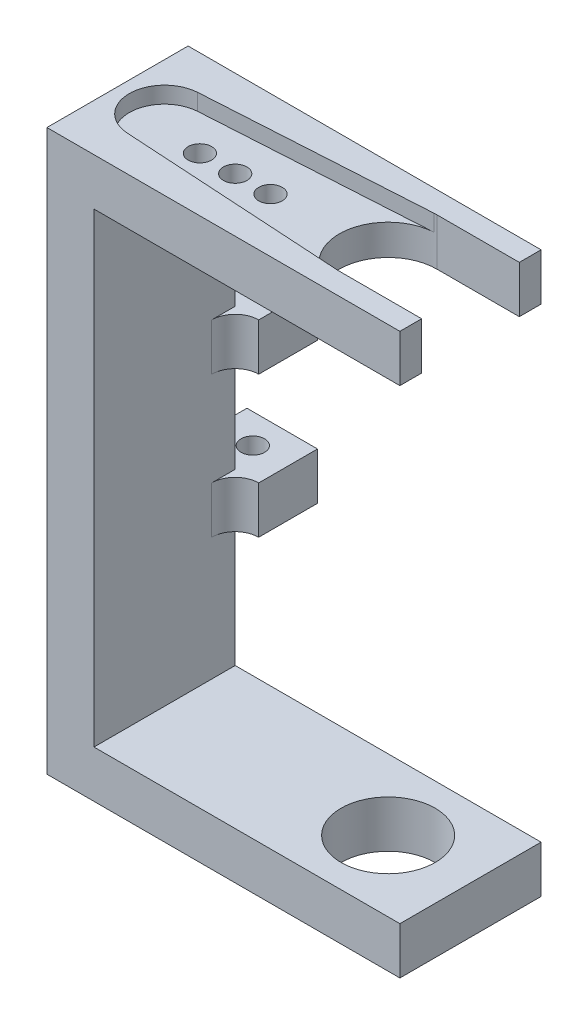
ISO-10303-21;
HEADER;
FILE_DESCRIPTION(('STEP AP214'),'2;1');
FILE_NAME('part.step','',(''),(''),'','','');
FILE_SCHEMA(('AUTOMOTIVE_DESIGN { 1 0 10303 214 1 1 1 1 }'));
ENDSEC;
DATA;
#1=APPLICATION_CONTEXT('core data for automotive mechanical design processes');
#2=APPLICATION_PROTOCOL_DEFINITION('international standard','automotive_design',2000,#1);
#3=PRODUCT_CONTEXT('',#1,'mechanical');
#4=PRODUCT('Part','Part','',(#3));
#5=PRODUCT_RELATED_PRODUCT_CATEGORY('part','',(#4));
#6=PRODUCT_DEFINITION_FORMATION('','',#4);
#7=PRODUCT_DEFINITION_CONTEXT('part definition',#1,'design');
#8=PRODUCT_DEFINITION('design','',#6,#7);
#9=PRODUCT_DEFINITION_SHAPE('','',#8);
#10=(LENGTH_UNIT() NAMED_UNIT(*) SI_UNIT(.MILLI.,.METRE.));
#11=(NAMED_UNIT(*) PLANE_ANGLE_UNIT() SI_UNIT($,.RADIAN.));
#12=(NAMED_UNIT(*) SI_UNIT($,.STERADIAN.) SOLID_ANGLE_UNIT());
#13=UNCERTAINTY_MEASURE_WITH_UNIT(LENGTH_MEASURE(1.E-05),#10,'distance_accuracy_value','');
#14=(GEOMETRIC_REPRESENTATION_CONTEXT(3) GLOBAL_UNCERTAINTY_ASSIGNED_CONTEXT((#13)) GLOBAL_UNIT_ASSIGNED_CONTEXT((#10,
#11,#12)) REPRESENTATION_CONTEXT('',''));
#15=CARTESIAN_POINT('',(0.,0.,0.));
#16=DIRECTION('',(0.,0.,1.));
#17=DIRECTION('',(1.,0.,0.));
#18=AXIS2_PLACEMENT_3D('',#15,#16,#17);
#19=CARTESIAN_POINT('',(-20.,0.,0.));
#20=DIRECTION('',(0.,0.,1.));
#21=DIRECTION('',(-1.,0.,0.));
#22=AXIS2_PLACEMENT_3D('',#19,#20,#21);
#23=PLANE('',#22);
#24=DIRECTION('',(1.,0.,0.));
#25=VECTOR('',#24,1.);
#26=CARTESIAN_POINT('',(-20.,10.44,0.));
#27=LINE('',#26,#25);
#28=CARTESIAN_POINT('',(-50.,10.44,0.));
#29=VERTEX_POINT('',#28);
#30=CARTESIAN_POINT('',(-46.,10.44,0.));
#31=VERTEX_POINT('',#30);
#32=EDGE_CURVE('E295',#29,#31,#27,.T.);
#33=ORIENTED_EDGE('',*,*,#32,.T.);
#34=DIRECTION('',(0.,-1.,0.));
#35=VECTOR('',#34,1.);
#36=CARTESIAN_POINT('',(-46.,0.,0.));
#37=LINE('',#36,#35);
#38=CARTESIAN_POINT('',(-46.,0.,0.));
#39=VERTEX_POINT('',#38);
#40=EDGE_CURVE('E430',#31,#39,#37,.T.);
#41=ORIENTED_EDGE('',*,*,#40,.T.);
#42=DIRECTION('',(1.,0.,0.));
#43=VECTOR('',#42,1.);
#44=CARTESIAN_POINT('',(-20.,0.,0.));
#45=LINE('',#44,#43);
#46=CARTESIAN_POINT('',(-20.,0.,0.));
#47=VERTEX_POINT('',#46);
#48=EDGE_CURVE('E392',#39,#47,#45,.T.);
#49=ORIENTED_EDGE('',*,*,#48,.T.);
#50=DIRECTION('',(0.,-1.,0.));
#51=VECTOR('',#50,1.);
#52=CARTESIAN_POINT('',(-20.,0.,0.));
#53=LINE('',#52,#51);
#54=CARTESIAN_POINT('',(-20.,-4.,0.));
#55=VERTEX_POINT('',#54);
#56=EDGE_CURVE('E385',#47,#55,#53,.T.);
#57=ORIENTED_EDGE('',*,*,#56,.T.);
#58=DIRECTION('',(-1.,0.,0.));
#59=VECTOR('',#58,1.);
#60=CARTESIAN_POINT('',(-20.,-4.,0.));
#61=LINE('',#60,#59);
#62=CARTESIAN_POINT('',(-50.,-4.,0.));
#63=VERTEX_POINT('',#62);
#64=EDGE_CURVE('E414',#55,#63,#61,.T.);
#65=ORIENTED_EDGE('',*,*,#64,.T.);
#66=DIRECTION('',(0.,1.,0.));
#67=VECTOR('',#66,1.);
#68=CARTESIAN_POINT('',(-50.,-4.,0.));
#69=LINE('',#68,#67);
#70=EDGE_CURVE('E418',#63,#29,#69,.T.);
#71=ORIENTED_EDGE('',*,*,#70,.T.);
#72=EDGE_LOOP('',(#33,#41,#49,#57,#65,#71));
#73=FACE_BOUND('',#72,.T.);
#74=ADVANCED_FACE('F43',(#73),#23,.F.);
#75=DIRECTION('',(-1.,0.,0.));
#76=VECTOR('',#75,1.);
#77=CARTESIAN_POINT('',(-44.,26.44,0.));
#78=LINE('',#77,#76);
#79=CARTESIAN_POINT('',(-46.,26.44,0.));
#80=VERTEX_POINT('',#79);
#81=CARTESIAN_POINT('',(-50.,26.44,0.));
#82=VERTEX_POINT('',#81);
#83=EDGE_CURVE('E278',#80,#82,#78,.T.);
#84=ORIENTED_EDGE('',*,*,#83,.T.);
#85=CARTESIAN_POINT('',(-50.,43.6,0.));
#86=VERTEX_POINT('',#85);
#87=EDGE_CURVE('E417',#82,#86,#69,.T.);
#88=ORIENTED_EDGE('',*,*,#87,.T.);
#89=DIRECTION('',(1.,0.,0.));
#90=VECTOR('',#89,1.);
#91=CARTESIAN_POINT('',(-50.,43.6,0.));
#92=LINE('',#91,#90);
#93=CARTESIAN_POINT('',(-20.,43.6,0.));
#94=VERTEX_POINT('',#93);
#95=EDGE_CURVE('E421',#86,#94,#92,.T.);
#96=ORIENTED_EDGE('',*,*,#95,.T.);
#97=DIRECTION('',(0.,-1.,0.));
#98=VECTOR('',#97,1.);
#99=CARTESIAN_POINT('',(-20.,43.6,0.));
#100=LINE('',#99,#98);
#101=CARTESIAN_POINT('',(-20.,39.6,0.));
#102=VERTEX_POINT('',#101);
#103=EDGE_CURVE('E424',#94,#102,#100,.T.);
#104=ORIENTED_EDGE('',*,*,#103,.T.);
#105=DIRECTION('',(-1.,0.,0.));
#106=VECTOR('',#105,1.);
#107=CARTESIAN_POINT('',(-46.,39.6,0.));
#108=LINE('',#107,#106);
#109=CARTESIAN_POINT('',(-46.,39.6,0.));
#110=VERTEX_POINT('',#109);
#111=EDGE_CURVE('E427',#102,#110,#108,.T.);
#112=ORIENTED_EDGE('',*,*,#111,.T.);
#113=EDGE_CURVE('E431',#110,#80,#37,.T.);
#114=ORIENTED_EDGE('',*,*,#113,.T.);
#115=EDGE_LOOP('',(#84,#88,#96,#104,#112,#114));
#116=FACE_BOUND('',#115,.T.);
#117=ADVANCED_FACE('F511',(#116),#23,.F.);
#118=CARTESIAN_POINT('',(-50.,43.6,12.));
#119=DIRECTION('',(0.,-1.,0.));
#120=DIRECTION('',(0.,0.,-1.));
#121=AXIS2_PLACEMENT_3D('',#118,#119,#120);
#122=PLANE('',#121);
#123=CARTESIAN_POINT('',(-46.,43.6,6.));
#124=DIRECTION('',(0.,-1.,0.));
#125=DIRECTION('',(0.,0.,1.));
#126=AXIS2_PLACEMENT_3D('',#123,#124,#125);
#127=CIRCLE('',#126,3.);
#128=CARTESIAN_POINT('',(-46.1815789473684,43.6,8.99449980562239));
#129=VERTEX_POINT('',#128);
#130=CARTESIAN_POINT('',(-46.1815789473684,43.6,3.0055001943776));
#131=VERTEX_POINT('',#130);
#132=EDGE_CURVE('E343',#129,#131,#127,.T.);
#133=ORIENTED_EDGE('',*,*,#132,.T.);
#134=DIRECTION('',(-0.998166601874133,0.,0.0605263157894736));
#135=VECTOR('',#134,1.);
#136=CARTESIAN_POINT('',(-19.9143361731144,43.6,1.41272056411529));
#137=LINE('',#136,#135);
#138=CARTESIAN_POINT('',(-27.2511842105263,43.6,1.85760860222235));
#139=VERTEX_POINT('',#138);
#140=EDGE_CURVE('E332',#139,#131,#137,.T.);
#141=ORIENTED_EDGE('',*,*,#140,.F.);
#142=CARTESIAN_POINT('',(-27.,43.6,6.));
#143=DIRECTION('',(0.,-1.,0.));
#144=DIRECTION('',(0.,0.,1.));
#145=AXIS2_PLACEMENT_3D('',#142,#143,#144);
#146=CIRCLE('',#145,4.15);
#147=CARTESIAN_POINT('',(-27.,43.6,1.85));
#148=VERTEX_POINT('',#147);
#149=EDGE_CURVE('E350',#139,#148,#146,.T.);
#150=ORIENTED_EDGE('',*,*,#149,.T.);
#151=DIRECTION('',(1.,0.,0.));
#152=VECTOR('',#151,1.);
#153=CARTESIAN_POINT('',(-20.,43.6,1.85));
#154=LINE('',#153,#152);
#155=CARTESIAN_POINT('',(-20.,43.6,1.85));
#156=VERTEX_POINT('',#155);
#157=EDGE_CURVE('E369',#148,#156,#154,.T.);
#158=ORIENTED_EDGE('',*,*,#157,.T.);
#159=DIRECTION('',(0.,0.,-1.));
#160=VECTOR('',#159,1.);
#161=CARTESIAN_POINT('',(-20.,43.6,12.));
#162=LINE('',#161,#160);
#163=EDGE_CURVE('E445',#156,#94,#162,.T.);
#164=ORIENTED_EDGE('',*,*,#163,.T.);
#165=ORIENTED_EDGE('',*,*,#95,.F.);
#166=DIRECTION('',(0.,0.,-1.));
#167=VECTOR('',#166,1.);
#168=CARTESIAN_POINT('',(-50.,43.6,12.));
#169=LINE('',#168,#167);
#170=CARTESIAN_POINT('',(-50.,43.6,12.));
#171=VERTEX_POINT('',#170);
#172=EDGE_CURVE('E449',#171,#86,#169,.T.);
#173=ORIENTED_EDGE('',*,*,#172,.F.);
#174=DIRECTION('',(1.,0.,0.));
#175=VECTOR('',#174,1.);
#176=CARTESIAN_POINT('',(-50.,43.6,12.));
#177=LINE('',#176,#175);
#178=CARTESIAN_POINT('',(-20.,43.6,12.));
#179=VERTEX_POINT('',#178);
#180=EDGE_CURVE('E397',#171,#179,#177,.T.);
#181=ORIENTED_EDGE('',*,*,#180,.T.);
#182=CARTESIAN_POINT('',(-20.,43.6,10.15));
#183=VERTEX_POINT('',#182);
#184=EDGE_CURVE('E446',#179,#183,#162,.T.);
#185=ORIENTED_EDGE('',*,*,#184,.T.);
#186=DIRECTION('',(1.,0.,0.));
#187=VECTOR('',#186,1.);
#188=CARTESIAN_POINT('',(-20.,43.6,10.15));
#189=LINE('',#188,#187);
#190=CARTESIAN_POINT('',(-27.,43.6,10.15));
#191=VERTEX_POINT('',#190);
#192=EDGE_CURVE('E360',#191,#183,#189,.T.);
#193=ORIENTED_EDGE('',*,*,#192,.F.);
#194=CARTESIAN_POINT('',(-27.2511842105263,43.6,10.1423913977776));
#195=VERTEX_POINT('',#194);
#196=EDGE_CURVE('E366',#191,#195,#146,.T.);
#197=ORIENTED_EDGE('',*,*,#196,.T.);
#198=DIRECTION('',(-0.998166601874133,0.,-0.0605263157894737));
#199=VECTOR('',#198,1.);
#200=CARTESIAN_POINT('',(-20.6393203365809,43.6,10.5433182170481));
#201=LINE('',#200,#199);
#202=EDGE_CURVE('E327',#195,#129,#201,.T.);
#203=ORIENTED_EDGE('',*,*,#202,.T.);
#204=EDGE_LOOP('',(#133,#141,#150,#158,#164,#165,#173,#181,#185,#193,#197,#203));
#205=FACE_BOUND('',#204,.T.);
#206=ADVANCED_FACE('F517',(#205),#122,.F.);
#207=CARTESIAN_POINT('',(-20.,43.6,12.));
#208=DIRECTION('',(-1.,0.,0.));
#209=DIRECTION('',(0.,1.,0.));
#210=AXIS2_PLACEMENT_3D('',#207,#208,#209);
#211=PLANE('',#210);
#212=DIRECTION('',(0.,1.,0.));
#213=VECTOR('',#212,1.);
#214=CARTESIAN_POINT('',(-20.,39.6,10.15));
#215=LINE('',#214,#213);
#216=CARTESIAN_POINT('',(-20.,39.6,10.15));
#217=VERTEX_POINT('',#216);
#218=EDGE_CURVE('E377',#217,#183,#215,.T.);
#219=ORIENTED_EDGE('',*,*,#218,.T.);
#220=ORIENTED_EDGE('',*,*,#184,.F.);
#221=DIRECTION('',(0.,-1.,0.));
#222=VECTOR('',#221,1.);
#223=CARTESIAN_POINT('',(-20.,43.6,12.));
#224=LINE('',#223,#222);
#225=CARTESIAN_POINT('',(-20.,39.6,12.));
#226=VERTEX_POINT('',#225);
#227=EDGE_CURVE('E400',#179,#226,#224,.T.);
#228=ORIENTED_EDGE('',*,*,#227,.T.);
#229=DIRECTION('',(0.,0.,-1.));
#230=VECTOR('',#229,1.);
#231=CARTESIAN_POINT('',(-20.,39.6,12.));
#232=LINE('',#231,#230);
#233=EDGE_CURVE('E442',#226,#217,#232,.T.);
#234=ORIENTED_EDGE('',*,*,#233,.T.);
#235=EDGE_LOOP('',(#219,#220,#228,#234));
#236=FACE_BOUND('',#235,.T.);
#237=ADVANCED_FACE('F588',(#236),#211,.F.);
#238=CARTESIAN_POINT('',(-46.,39.6,12.));
#239=DIRECTION('',(0.,1.,0.));
#240=DIRECTION('',(0.,0.,1.));
#241=AXIS2_PLACEMENT_3D('',#238,#239,#240);
#242=PLANE('',#241);
#243=CARTESIAN_POINT('',(-43.,39.6,6.));
#244=DIRECTION('',(0.,-1.,0.));
#245=DIRECTION('',(0.,0.,1.));
#246=AXIS2_PLACEMENT_3D('',#243,#244,#245);
#247=CIRCLE('',#246,1.);
#248=CARTESIAN_POINT('',(-43.,39.6,7.));
#249=VERTEX_POINT('',#248);
#250=EDGE_CURVE('E310',#249,#249,#247,.T.);
#251=ORIENTED_EDGE('',*,*,#250,.F.);
#252=EDGE_LOOP('',(#251));
#253=FACE_BOUND('',#252,.T.);
#254=CARTESIAN_POINT('',(-40.,39.6,6.));
#255=DIRECTION('',(0.,-1.,0.));
#256=DIRECTION('',(0.,0.,1.));
#257=AXIS2_PLACEMENT_3D('',#254,#255,#256);
#258=CIRCLE('',#257,1.);
#259=CARTESIAN_POINT('',(-40.,39.6,7.));
#260=VERTEX_POINT('',#259);
#261=EDGE_CURVE('E314',#260,#260,#258,.T.);
#262=ORIENTED_EDGE('',*,*,#261,.F.);
#263=EDGE_LOOP('',(#262));
#264=FACE_BOUND('',#263,.T.);
#265=CARTESIAN_POINT('',(-37.,39.6,6.));
#266=DIRECTION('',(0.,-1.,0.));
#267=DIRECTION('',(0.,0.,1.));
#268=AXIS2_PLACEMENT_3D('',#265,#266,#267);
#269=CIRCLE('',#268,1.);
#270=CARTESIAN_POINT('',(-37.,39.6,7.));
#271=VERTEX_POINT('',#270);
#272=EDGE_CURVE('E309',#271,#271,#269,.T.);
#273=ORIENTED_EDGE('',*,*,#272,.F.);
#274=EDGE_LOOP('',(#273));
#275=FACE_BOUND('',#274,.T.);
#276=DIRECTION('',(1.,0.,0.));
#277=VECTOR('',#276,1.);
#278=CARTESIAN_POINT('',(-20.,39.6,10.15));
#279=LINE('',#278,#277);
#280=CARTESIAN_POINT('',(-27.,39.6,10.15));
#281=VERTEX_POINT('',#280);
#282=EDGE_CURVE('E363',#281,#217,#279,.T.);
#283=ORIENTED_EDGE('',*,*,#282,.T.);
#284=ORIENTED_EDGE('',*,*,#233,.F.);
#285=DIRECTION('',(-1.,0.,0.));
#286=VECTOR('',#285,1.);
#287=CARTESIAN_POINT('',(-46.,39.6,12.));
#288=LINE('',#287,#286);
#289=CARTESIAN_POINT('',(-46.,39.6,12.));
#290=VERTEX_POINT('',#289);
#291=EDGE_CURVE('E403',#226,#290,#288,.T.);
#292=ORIENTED_EDGE('',*,*,#291,.T.);
#293=DIRECTION('',(0.,0.,-1.));
#294=VECTOR('',#293,1.);
#295=CARTESIAN_POINT('',(-46.,39.6,12.));
#296=LINE('',#295,#294);
#297=EDGE_CURVE('E439',#290,#110,#296,.T.);
#298=ORIENTED_EDGE('',*,*,#297,.T.);
#299=ORIENTED_EDGE('',*,*,#111,.F.);
#300=CARTESIAN_POINT('',(-20.,39.6,1.85));
#301=VERTEX_POINT('',#300);
#302=EDGE_CURVE('E441',#301,#102,#232,.T.);
#303=ORIENTED_EDGE('',*,*,#302,.F.);
#304=DIRECTION('',(1.,0.,0.));
#305=VECTOR('',#304,1.);
#306=CARTESIAN_POINT('',(-20.,39.6,1.85));
#307=LINE('',#306,#305);
#308=CARTESIAN_POINT('',(-27.,39.6,1.85));
#309=VERTEX_POINT('',#308);
#310=EDGE_CURVE('E359',#309,#301,#307,.T.);
#311=ORIENTED_EDGE('',*,*,#310,.F.);
#312=CARTESIAN_POINT('',(-27.,39.6,6.));
#313=DIRECTION('',(0.,-1.,0.));
#314=DIRECTION('',(0.,0.,1.));
#315=AXIS2_PLACEMENT_3D('',#312,#313,#314);
#316=CIRCLE('',#315,4.15);
#317=EDGE_CURVE('E356',#281,#309,#316,.T.);
#318=ORIENTED_EDGE('',*,*,#317,.F.);
#319=EDGE_LOOP('',(#283,#284,#292,#298,#299,#303,#311,#318));
#320=FACE_BOUND('',#319,.T.);
#321=ADVANCED_FACE('F584',(#253,#264,#275,#320),#242,.F.);
#322=CARTESIAN_POINT('',(-20.,0.,12.));
#323=DIRECTION('',(-1.,0.,0.));
#324=DIRECTION('',(0.,0.,-1.));
#325=AXIS2_PLACEMENT_3D('',#322,#323,#324);
#326=PLANE('',#325);
#327=ORIENTED_EDGE('',*,*,#56,.F.);
#328=DIRECTION('',(0.,0.,-1.));
#329=VECTOR('',#328,1.);
#330=CARTESIAN_POINT('',(-20.,0.,12.));
#331=LINE('',#330,#329);
#332=CARTESIAN_POINT('',(-20.,0.,12.));
#333=VERTEX_POINT('',#332);
#334=EDGE_CURVE('E411',#333,#47,#331,.T.);
#335=ORIENTED_EDGE('',*,*,#334,.F.);
#336=DIRECTION('',(0.,-1.,0.));
#337=VECTOR('',#336,1.);
#338=CARTESIAN_POINT('',(-20.,0.,12.));
#339=LINE('',#338,#337);
#340=CARTESIAN_POINT('',(-20.,-4.,12.));
#341=VERTEX_POINT('',#340);
#342=EDGE_CURVE('E388',#333,#341,#339,.T.);
#343=ORIENTED_EDGE('',*,*,#342,.T.);
#344=DIRECTION('',(0.,0.,-1.));
#345=VECTOR('',#344,1.);
#346=CARTESIAN_POINT('',(-20.,-4.,12.));
#347=LINE('',#346,#345);
#348=EDGE_CURVE('E282',#341,#55,#347,.T.);
#349=ORIENTED_EDGE('',*,*,#348,.T.);
#350=EDGE_LOOP('',(#327,#335,#343,#349));
#351=FACE_BOUND('',#350,.T.);
#352=ADVANCED_FACE('F587',(#351),#326,.F.);
#353=CARTESIAN_POINT('',(-20.,-4.,12.));
#354=DIRECTION('',(0.,1.,0.));
#355=DIRECTION('',(0.,0.,1.));
#356=AXIS2_PLACEMENT_3D('',#353,#354,#355);
#357=PLANE('',#356);
#358=CARTESIAN_POINT('',(-27.,-4.,6.));
#359=DIRECTION('',(0.,1.,0.));
#360=DIRECTION('',(0.,0.,-1.));
#361=AXIS2_PLACEMENT_3D('',#358,#359,#360);
#362=CIRCLE('',#361,4.);
#363=CARTESIAN_POINT('',(-27.,-4.,2.));
#364=VERTEX_POINT('',#363);
#365=EDGE_CURVE('E376',#364,#364,#362,.T.);
#366=ORIENTED_EDGE('',*,*,#365,.T.);
#367=EDGE_LOOP('',(#366));
#368=FACE_BOUND('',#367,.T.);
#369=ORIENTED_EDGE('',*,*,#64,.F.);
#370=ORIENTED_EDGE('',*,*,#348,.F.);
#371=DIRECTION('',(-1.,0.,0.));
#372=VECTOR('',#371,1.);
#373=CARTESIAN_POINT('',(-20.,-4.,12.));
#374=LINE('',#373,#372);
#375=CARTESIAN_POINT('',(-50.,-4.,12.));
#376=VERTEX_POINT('',#375);
#377=EDGE_CURVE('E391',#341,#376,#374,.T.);
#378=ORIENTED_EDGE('',*,*,#377,.T.);
#379=DIRECTION('',(0.,0.,-1.));
#380=VECTOR('',#379,1.);
#381=CARTESIAN_POINT('',(-50.,-4.,12.));
#382=LINE('',#381,#380);
#383=EDGE_CURVE('E451',#376,#63,#382,.T.);
#384=ORIENTED_EDGE('',*,*,#383,.T.);
#385=EDGE_LOOP('',(#369,#370,#378,#384));
#386=FACE_BOUND('',#385,.T.);
#387=ADVANCED_FACE('F637',(#368,#386),#357,.F.);
#388=CARTESIAN_POINT('',(-50.,-4.,12.));
#389=DIRECTION('',(1.,0.,0.));
#390=DIRECTION('',(0.,0.,1.));
#391=AXIS2_PLACEMENT_3D('',#388,#389,#390);
#392=PLANE('',#391);
#393=ORIENTED_EDGE('',*,*,#70,.F.);
#394=ORIENTED_EDGE('',*,*,#383,.F.);
#395=DIRECTION('',(0.,1.,0.));
#396=VECTOR('',#395,1.);
#397=CARTESIAN_POINT('',(-50.,-4.,12.));
#398=LINE('',#397,#396);
#399=EDGE_CURVE('E395',#376,#171,#398,.T.);
#400=ORIENTED_EDGE('',*,*,#399,.T.);
#401=ORIENTED_EDGE('',*,*,#172,.T.);
#402=ORIENTED_EDGE('',*,*,#87,.F.);
#403=DIRECTION('',(0.,0.,-1.));
#404=VECTOR('',#403,1.);
#405=CARTESIAN_POINT('',(-50.,26.44,0.));
#406=LINE('',#405,#404);
#407=CARTESIAN_POINT('',(-50.,26.44,-5.));
#408=VERTEX_POINT('',#407);
#409=EDGE_CURVE('E283',#82,#408,#406,.T.);
#410=ORIENTED_EDGE('',*,*,#409,.T.);
#411=DIRECTION('',(0.,-1.,0.));
#412=VECTOR('',#411,1.);
#413=CARTESIAN_POINT('',(-50.,26.44,-5.));
#414=LINE('',#413,#412);
#415=CARTESIAN_POINT('',(-50.,22.44,-5.));
#416=VERTEX_POINT('',#415);
#417=EDGE_CURVE('E306',#408,#416,#414,.T.);
#418=ORIENTED_EDGE('',*,*,#417,.T.);
#419=DIRECTION('',(0.,0.,-1.));
#420=VECTOR('',#419,1.);
#421=CARTESIAN_POINT('',(-50.,22.44,0.));
#422=LINE('',#421,#420);
#423=CARTESIAN_POINT('',(-50.,22.44,0.));
#424=VERTEX_POINT('',#423);
#425=EDGE_CURVE('E275',#424,#416,#422,.T.);
#426=ORIENTED_EDGE('',*,*,#425,.F.);
#427=CARTESIAN_POINT('',(-50.,14.44,0.));
#428=VERTEX_POINT('',#427);
#429=EDGE_CURVE('E255',#428,#424,#69,.T.);
#430=ORIENTED_EDGE('',*,*,#429,.F.);
#431=DIRECTION('',(0.,0.,-1.));
#432=VECTOR('',#431,1.);
#433=CARTESIAN_POINT('',(-50.,14.44,0.));
#434=LINE('',#433,#432);
#435=CARTESIAN_POINT('',(-50.,14.44,-5.));
#436=VERTEX_POINT('',#435);
#437=EDGE_CURVE('E234',#428,#436,#434,.T.);
#438=ORIENTED_EDGE('',*,*,#437,.T.);
#439=DIRECTION('',(0.,-1.,0.));
#440=VECTOR('',#439,1.);
#441=CARTESIAN_POINT('',(-50.,14.44,-5.));
#442=LINE('',#441,#440);
#443=CARTESIAN_POINT('',(-50.,10.44,-5.));
#444=VERTEX_POINT('',#443);
#445=EDGE_CURVE('E242',#436,#444,#442,.T.);
#446=ORIENTED_EDGE('',*,*,#445,.T.);
#447=DIRECTION('',(0.,0.,-1.));
#448=VECTOR('',#447,1.);
#449=CARTESIAN_POINT('',(-50.,10.44,0.));
#450=LINE('',#449,#448);
#451=EDGE_CURVE('E266',#29,#444,#450,.T.);
#452=ORIENTED_EDGE('',*,*,#451,.F.);
#453=EDGE_LOOP('',(#393,#394,#400,#401,#402,#410,#418,#426,#430,#438,#446,#452));
#454=FACE_BOUND('',#453,.T.);
#455=ADVANCED_FACE('F252',(#454),#392,.F.);
#456=ORIENTED_EDGE('',*,*,#302,.T.);
#457=ORIENTED_EDGE('',*,*,#103,.F.);
#458=ORIENTED_EDGE('',*,*,#163,.F.);
#459=DIRECTION('',(0.,1.,0.));
#460=VECTOR('',#459,1.);
#461=CARTESIAN_POINT('',(-20.,39.6,1.85));
#462=LINE('',#461,#460);
#463=EDGE_CURVE('E379',#301,#156,#462,.T.);
#464=ORIENTED_EDGE('',*,*,#463,.F.);
#465=EDGE_LOOP('',(#456,#457,#458,#464));
#466=FACE_BOUND('',#465,.T.);
#467=ADVANCED_FACE('F615',(#466),#211,.F.);
#468=CARTESIAN_POINT('',(-46.,0.,12.));
#469=DIRECTION('',(-1.,0.,0.));
#470=DIRECTION('',(0.,0.,-1.));
#471=AXIS2_PLACEMENT_3D('',#468,#469,#470);
#472=PLANE('',#471);
#473=DIRECTION('',(0.,-1.,0.));
#474=VECTOR('',#473,1.);
#475=CARTESIAN_POINT('',(-46.,10.44,2.));
#476=LINE('',#475,#474);
#477=CARTESIAN_POINT('',(-46.,14.44,2.));
#478=VERTEX_POINT('',#477);
#479=CARTESIAN_POINT('',(-46.,10.44,2.));
#480=VERTEX_POINT('',#479);
#481=EDGE_CURVE('E466',#478,#480,#476,.T.);
#482=ORIENTED_EDGE('',*,*,#481,.F.);
#483=DIRECTION('',(0.,0.,1.));
#484=VECTOR('',#483,1.);
#485=CARTESIAN_POINT('',(-46.,14.44,12.));
#486=LINE('',#485,#484);
#487=CARTESIAN_POINT('',(-46.,14.44,0.));
#488=VERTEX_POINT('',#487);
#489=EDGE_CURVE('E464',#488,#478,#486,.T.);
#490=ORIENTED_EDGE('',*,*,#489,.F.);
#491=CARTESIAN_POINT('',(-46.,22.44,0.));
#492=VERTEX_POINT('',#491);
#493=EDGE_CURVE('E433',#492,#488,#37,.T.);
#494=ORIENTED_EDGE('',*,*,#493,.F.);
#495=DIRECTION('',(0.,0.,-1.));
#496=VECTOR('',#495,1.);
#497=CARTESIAN_POINT('',(-46.,22.44,0.));
#498=LINE('',#497,#496);
#499=CARTESIAN_POINT('',(-46.,22.44,2.));
#500=VERTEX_POINT('',#499);
#501=EDGE_CURVE('E461',#500,#492,#498,.T.);
#502=ORIENTED_EDGE('',*,*,#501,.F.);
#503=DIRECTION('',(0.,-1.,0.));
#504=VECTOR('',#503,1.);
#505=CARTESIAN_POINT('',(-46.,22.44,2.));
#506=LINE('',#505,#504);
#507=CARTESIAN_POINT('',(-46.,26.44,2.));
#508=VERTEX_POINT('',#507);
#509=EDGE_CURVE('E458',#508,#500,#506,.T.);
#510=ORIENTED_EDGE('',*,*,#509,.F.);
#511=DIRECTION('',(0.,0.,1.));
#512=VECTOR('',#511,1.);
#513=CARTESIAN_POINT('',(-46.,26.44,12.));
#514=LINE('',#513,#512);
#515=EDGE_CURVE('E58',#80,#508,#514,.T.);
#516=ORIENTED_EDGE('',*,*,#515,.F.);
#517=ORIENTED_EDGE('',*,*,#113,.F.);
#518=ORIENTED_EDGE('',*,*,#297,.F.);
#519=DIRECTION('',(0.,-1.,0.));
#520=VECTOR('',#519,1.);
#521=CARTESIAN_POINT('',(-46.,0.,12.));
#522=LINE('',#521,#520);
#523=CARTESIAN_POINT('',(-46.,0.,12.));
#524=VERTEX_POINT('',#523);
#525=EDGE_CURVE('E406',#290,#524,#522,.T.);
#526=ORIENTED_EDGE('',*,*,#525,.T.);
#527=DIRECTION('',(0.,0.,-1.));
#528=VECTOR('',#527,1.);
#529=CARTESIAN_POINT('',(-46.,0.,12.));
#530=LINE('',#529,#528);
#531=EDGE_CURVE('E437',#524,#39,#530,.T.);
#532=ORIENTED_EDGE('',*,*,#531,.T.);
#533=ORIENTED_EDGE('',*,*,#40,.F.);
#534=DIRECTION('',(0.,0.,-1.));
#535=VECTOR('',#534,1.);
#536=CARTESIAN_POINT('',(-46.,10.44,0.));
#537=LINE('',#536,#535);
#538=EDGE_CURVE('E469',#480,#31,#537,.T.);
#539=ORIENTED_EDGE('',*,*,#538,.F.);
#540=EDGE_LOOP('',(#482,#490,#494,#502,#510,#516,#517,#518,#526,#532,#533,#539));
#541=FACE_BOUND('',#540,.T.);
#542=ADVANCED_FACE('F492',(#541),#472,.F.);
#543=CARTESIAN_POINT('',(-20.,0.,12.));
#544=DIRECTION('',(0.,-1.,0.));
#545=DIRECTION('',(0.,0.,-1.));
#546=AXIS2_PLACEMENT_3D('',#543,#544,#545);
#547=PLANE('',#546);
#548=CARTESIAN_POINT('',(-27.,0.,6.));
#549=DIRECTION('',(0.,1.,0.));
#550=DIRECTION('',(0.,0.,-1.));
#551=AXIS2_PLACEMENT_3D('',#548,#549,#550);
#552=CIRCLE('',#551,4.);
#553=CARTESIAN_POINT('',(-27.,0.,2.));
#554=VERTEX_POINT('',#553);
#555=EDGE_CURVE('E382',#554,#554,#552,.T.);
#556=ORIENTED_EDGE('',*,*,#555,.F.);
#557=EDGE_LOOP('',(#556));
#558=FACE_BOUND('',#557,.T.);
#559=ORIENTED_EDGE('',*,*,#48,.F.);
#560=ORIENTED_EDGE('',*,*,#531,.F.);
#561=DIRECTION('',(1.,0.,0.));
#562=VECTOR('',#561,1.);
#563=CARTESIAN_POINT('',(-20.,0.,12.));
#564=LINE('',#563,#562);
#565=EDGE_CURVE('E409',#524,#333,#564,.T.);
#566=ORIENTED_EDGE('',*,*,#565,.T.);
#567=ORIENTED_EDGE('',*,*,#334,.T.);
#568=EDGE_LOOP('',(#559,#560,#566,#567));
#569=FACE_BOUND('',#568,.T.);
#570=ADVANCED_FACE('F531',(#558,#569),#547,.F.);
#571=CARTESIAN_POINT('',(-20.,0.,12.));
#572=DIRECTION('',(0.,0.,1.));
#573=DIRECTION('',(-1.,0.,0.));
#574=AXIS2_PLACEMENT_3D('',#571,#572,#573);
#575=PLANE('',#574);
#576=ORIENTED_EDGE('',*,*,#342,.F.);
#577=ORIENTED_EDGE('',*,*,#565,.F.);
#578=ORIENTED_EDGE('',*,*,#525,.F.);
#579=ORIENTED_EDGE('',*,*,#291,.F.);
#580=ORIENTED_EDGE('',*,*,#227,.F.);
#581=ORIENTED_EDGE('',*,*,#180,.F.);
#582=ORIENTED_EDGE('',*,*,#399,.F.);
#583=ORIENTED_EDGE('',*,*,#377,.F.);
#584=EDGE_LOOP('',(#576,#577,#578,#579,#580,#581,#582,#583));
#585=FACE_BOUND('',#584,.T.);
#586=ADVANCED_FACE('F523',(#585),#575,.T.);
#587=ORIENTED_EDGE('',*,*,#429,.T.);
#588=DIRECTION('',(-1.,0.,0.));
#589=VECTOR('',#588,1.);
#590=CARTESIAN_POINT('',(-44.,22.44,0.));
#591=LINE('',#590,#589);
#592=EDGE_CURVE('E281',#492,#424,#591,.T.);
#593=ORIENTED_EDGE('',*,*,#592,.F.);
#594=ORIENTED_EDGE('',*,*,#493,.T.);
#595=DIRECTION('',(1.,0.,0.));
#596=VECTOR('',#595,1.);
#597=CARTESIAN_POINT('',(-20.,14.44,0.));
#598=LINE('',#597,#596);
#599=EDGE_CURVE('E66',#428,#488,#598,.T.);
#600=ORIENTED_EDGE('',*,*,#599,.F.);
#601=EDGE_LOOP('',(#587,#593,#594,#600));
#602=FACE_BOUND('',#601,.T.);
#603=ADVANCED_FACE('F496',(#602),#23,.F.);
#604=CARTESIAN_POINT('',(-27.,0.,6.));
#605=DIRECTION('',(0.,-1.,0.));
#606=DIRECTION('',(0.,0.,-1.));
#607=AXIS2_PLACEMENT_3D('',#604,#605,#606);
#608=CYLINDRICAL_SURFACE('',#607,4.);
#609=ORIENTED_EDGE('',*,*,#555,.T.);
#610=EDGE_LOOP('',(#609));
#611=FACE_BOUND('',#610,.T.);
#612=ORIENTED_EDGE('',*,*,#365,.F.);
#613=EDGE_LOOP('',(#612));
#614=FACE_BOUND('',#613,.T.);
#615=ADVANCED_FACE('F522',(#611,#614),#608,.F.);
#616=CARTESIAN_POINT('',(-27.,39.6,6.));
#617=DIRECTION('',(0.,1.,0.));
#618=DIRECTION('',(0.,0.,1.));
#619=AXIS2_PLACEMENT_3D('',#616,#617,#618);
#620=CYLINDRICAL_SURFACE('',#619,4.15);
#621=ORIENTED_EDGE('',*,*,#196,.F.);
#622=DIRECTION('',(0.,1.,0.));
#623=VECTOR('',#622,1.);
#624=CARTESIAN_POINT('',(-27.,39.6,10.15));
#625=LINE('',#624,#623);
#626=EDGE_CURVE('E374',#281,#191,#625,.T.);
#627=ORIENTED_EDGE('',*,*,#626,.F.);
#628=ORIENTED_EDGE('',*,*,#317,.T.);
#629=DIRECTION('',(0.,1.,0.));
#630=VECTOR('',#629,1.);
#631=CARTESIAN_POINT('',(-27.,39.6,1.85));
#632=LINE('',#631,#630);
#633=EDGE_CURVE('E365',#309,#148,#632,.T.);
#634=ORIENTED_EDGE('',*,*,#633,.T.);
#635=ORIENTED_EDGE('',*,*,#149,.F.);
#636=DIRECTION('',(0.,1.,0.));
#637=VECTOR('',#636,1.);
#638=CARTESIAN_POINT('',(-27.2511842105263,42.2,1.85760860222235));
#639=LINE('',#638,#637);
#640=CARTESIAN_POINT('',(-27.2511842105263,42.2,1.85760860222235));
#641=VERTEX_POINT('',#640);
#642=EDGE_CURVE('E351',#641,#139,#639,.T.);
#643=ORIENTED_EDGE('',*,*,#642,.F.);
#644=CARTESIAN_POINT('',(-27.,42.2,6.));
#645=DIRECTION('',(0.,-1.,0.));
#646=DIRECTION('',(0.,0.,1.));
#647=AXIS2_PLACEMENT_3D('',#644,#645,#646);
#648=CIRCLE('',#647,4.15);
#649=CARTESIAN_POINT('',(-27.2511842105263,42.2,10.1423913977776));
#650=VERTEX_POINT('',#649);
#651=EDGE_CURVE('E337',#641,#650,#648,.F.);
#652=ORIENTED_EDGE('',*,*,#651,.T.);
#653=DIRECTION('',(0.,1.,0.));
#654=VECTOR('',#653,1.);
#655=CARTESIAN_POINT('',(-27.2511842105263,42.2,10.1423913977776));
#656=LINE('',#655,#654);
#657=EDGE_CURVE('E348',#650,#195,#656,.T.);
#658=ORIENTED_EDGE('',*,*,#657,.T.);
#659=EDGE_LOOP('',(#621,#627,#628,#634,#635,#643,#652,#658));
#660=FACE_BOUND('',#659,.T.);
#661=ADVANCED_FACE('F528',(#660),#620,.F.);
#662=CARTESIAN_POINT('',(-20.,39.6,10.15));
#663=DIRECTION('',(0.,0.,-1.));
#664=DIRECTION('',(1.,0.,0.));
#665=AXIS2_PLACEMENT_3D('',#662,#663,#664);
#666=PLANE('',#665);
#667=ORIENTED_EDGE('',*,*,#192,.T.);
#668=ORIENTED_EDGE('',*,*,#218,.F.);
#669=ORIENTED_EDGE('',*,*,#282,.F.);
#670=ORIENTED_EDGE('',*,*,#626,.T.);
#671=EDGE_LOOP('',(#667,#668,#669,#670));
#672=FACE_BOUND('',#671,.T.);
#673=ADVANCED_FACE('F541',(#672),#666,.T.);
#674=CARTESIAN_POINT('',(-20.,39.6,1.85));
#675=DIRECTION('',(0.,0.,-1.));
#676=DIRECTION('',(1.,0.,0.));
#677=AXIS2_PLACEMENT_3D('',#674,#675,#676);
#678=PLANE('',#677);
#679=ORIENTED_EDGE('',*,*,#157,.F.);
#680=ORIENTED_EDGE('',*,*,#633,.F.);
#681=ORIENTED_EDGE('',*,*,#310,.T.);
#682=ORIENTED_EDGE('',*,*,#463,.T.);
#683=EDGE_LOOP('',(#679,#680,#681,#682));
#684=FACE_BOUND('',#683,.T.);
#685=ADVANCED_FACE('F543',(#684),#678,.F.);
#686=CARTESIAN_POINT('',(-20.6393203365809,42.2,10.5433182170481));
#687=DIRECTION('',(-0.0605263157894737,0.,0.998166601874133));
#688=DIRECTION('',(-0.998166601874133,0.,-0.0605263157894737));
#689=AXIS2_PLACEMENT_3D('',#686,#687,#688);
#690=PLANE('',#689);
#691=ORIENTED_EDGE('',*,*,#202,.F.);
#692=ORIENTED_EDGE('',*,*,#657,.F.);
#693=DIRECTION('',(-0.998166601874133,0.,-0.0605263157894737));
#694=VECTOR('',#693,1.);
#695=CARTESIAN_POINT('',(-20.6393203365809,42.2,10.5433182170481));
#696=LINE('',#695,#694);
#697=CARTESIAN_POINT('',(-46.1815789473684,42.2,8.99449980562239));
#698=VERTEX_POINT('',#697);
#699=EDGE_CURVE('E328',#650,#698,#696,.T.);
#700=ORIENTED_EDGE('',*,*,#699,.T.);
#701=DIRECTION('',(0.,1.,0.));
#702=VECTOR('',#701,1.);
#703=CARTESIAN_POINT('',(-46.1815789473684,42.2,8.99449980562239));
#704=LINE('',#703,#702);
#705=EDGE_CURVE('E340',#698,#129,#704,.T.);
#706=ORIENTED_EDGE('',*,*,#705,.T.);
#707=EDGE_LOOP('',(#691,#692,#700,#706));
#708=FACE_BOUND('',#707,.T.);
#709=ADVANCED_FACE('F546',(#708),#690,.F.);
#710=CARTESIAN_POINT('',(-19.9143361731144,42.2,1.41272056411529));
#711=DIRECTION('',(0.0605263157894736,0.,0.998166601874133));
#712=DIRECTION('',(-0.998166601874133,0.,0.0605263157894736));
#713=AXIS2_PLACEMENT_3D('',#710,#711,#712);
#714=PLANE('',#713);
#715=ORIENTED_EDGE('',*,*,#140,.T.);
#716=DIRECTION('',(0.,1.,0.));
#717=VECTOR('',#716,1.);
#718=CARTESIAN_POINT('',(-46.1815789473684,42.2,3.0055001943776));
#719=LINE('',#718,#717);
#720=CARTESIAN_POINT('',(-46.1815789473684,42.2,3.0055001943776));
#721=VERTEX_POINT('',#720);
#722=EDGE_CURVE('E353',#721,#131,#719,.T.);
#723=ORIENTED_EDGE('',*,*,#722,.F.);
#724=DIRECTION('',(-0.998166601874133,0.,0.0605263157894736));
#725=VECTOR('',#724,1.);
#726=CARTESIAN_POINT('',(-19.9143361731144,42.2,1.41272056411529));
#727=LINE('',#726,#725);
#728=EDGE_CURVE('E334',#641,#721,#727,.T.);
#729=ORIENTED_EDGE('',*,*,#728,.F.);
#730=ORIENTED_EDGE('',*,*,#642,.T.);
#731=EDGE_LOOP('',(#715,#723,#729,#730));
#732=FACE_BOUND('',#731,.T.);
#733=ADVANCED_FACE('F553',(#732),#714,.T.);
#734=CARTESIAN_POINT('',(-46.,42.2,6.));
#735=DIRECTION('',(0.,1.,0.));
#736=DIRECTION('',(0.,0.,1.));
#737=AXIS2_PLACEMENT_3D('',#734,#735,#736);
#738=CYLINDRICAL_SURFACE('',#737,3.);
#739=ORIENTED_EDGE('',*,*,#132,.F.);
#740=ORIENTED_EDGE('',*,*,#705,.F.);
#741=CARTESIAN_POINT('',(-46.,42.2,6.));
#742=DIRECTION('',(0.,-1.,0.));
#743=DIRECTION('',(0.,0.,1.));
#744=AXIS2_PLACEMENT_3D('',#741,#742,#743);
#745=CIRCLE('',#744,3.);
#746=EDGE_CURVE('E331',#698,#721,#745,.T.);
#747=ORIENTED_EDGE('',*,*,#746,.T.);
#748=ORIENTED_EDGE('',*,*,#722,.T.);
#749=EDGE_LOOP('',(#739,#740,#747,#748));
#750=FACE_BOUND('',#749,.T.);
#751=ADVANCED_FACE('F555',(#750),#738,.F.);
#752=CARTESIAN_POINT('',(-20.,42.2,0.));
#753=DIRECTION('',(0.,1.,0.));
#754=DIRECTION('',(0.,0.,1.));
#755=AXIS2_PLACEMENT_3D('',#752,#753,#754);
#756=PLANE('',#755);
#757=ORIENTED_EDGE('',*,*,#699,.F.);
#758=ORIENTED_EDGE('',*,*,#651,.F.);
#759=ORIENTED_EDGE('',*,*,#728,.T.);
#760=ORIENTED_EDGE('',*,*,#746,.F.);
#761=EDGE_LOOP('',(#757,#758,#759,#760));
#762=FACE_BOUND('',#761,.T.);
#763=CARTESIAN_POINT('',(-37.,42.2,6.));
#764=DIRECTION('',(0.,-1.,0.));
#765=DIRECTION('',(0.,0.,1.));
#766=AXIS2_PLACEMENT_3D('',#763,#764,#765);
#767=CIRCLE('',#766,1.);
#768=CARTESIAN_POINT('',(-37.,42.2,7.));
#769=VERTEX_POINT('',#768);
#770=EDGE_CURVE('E321',#769,#769,#767,.T.);
#771=ORIENTED_EDGE('',*,*,#770,.T.);
#772=EDGE_LOOP('',(#771));
#773=FACE_BOUND('',#772,.T.);
#774=CARTESIAN_POINT('',(-40.,42.2,6.));
#775=DIRECTION('',(0.,-1.,0.));
#776=DIRECTION('',(0.,0.,1.));
#777=AXIS2_PLACEMENT_3D('',#774,#775,#776);
#778=CIRCLE('',#777,1.);
#779=CARTESIAN_POINT('',(-40.,42.2,7.));
#780=VERTEX_POINT('',#779);
#781=EDGE_CURVE('E313',#780,#780,#778,.T.);
#782=ORIENTED_EDGE('',*,*,#781,.T.);
#783=EDGE_LOOP('',(#782));
#784=FACE_BOUND('',#783,.T.);
#785=CARTESIAN_POINT('',(-43.,42.2,6.));
#786=DIRECTION('',(0.,-1.,0.));
#787=DIRECTION('',(0.,0.,1.));
#788=AXIS2_PLACEMENT_3D('',#785,#786,#787);
#789=CIRCLE('',#788,1.);
#790=CARTESIAN_POINT('',(-43.,42.2,7.));
#791=VERTEX_POINT('',#790);
#792=EDGE_CURVE('E324',#791,#791,#789,.T.);
#793=ORIENTED_EDGE('',*,*,#792,.T.);
#794=EDGE_LOOP('',(#793));
#795=FACE_BOUND('',#794,.T.);
#796=ADVANCED_FACE('F558',(#762,#773,#784,#795),#756,.T.);
#797=CARTESIAN_POINT('',(-37.,39.6,6.));
#798=DIRECTION('',(0.,1.,0.));
#799=DIRECTION('',(0.,0.,1.));
#800=AXIS2_PLACEMENT_3D('',#797,#798,#799);
#801=CYLINDRICAL_SURFACE('',#800,1.);
#802=ORIENTED_EDGE('',*,*,#770,.F.);
#803=EDGE_LOOP('',(#802));
#804=FACE_BOUND('',#803,.T.);
#805=ORIENTED_EDGE('',*,*,#272,.T.);
#806=EDGE_LOOP('',(#805));
#807=FACE_BOUND('',#806,.T.);
#808=ADVANCED_FACE('F565',(#804,#807),#801,.F.);
#809=CARTESIAN_POINT('',(-40.,39.6,6.));
#810=DIRECTION('',(0.,1.,0.));
#811=DIRECTION('',(0.,0.,1.));
#812=AXIS2_PLACEMENT_3D('',#809,#810,#811);
#813=CYLINDRICAL_SURFACE('',#812,1.);
#814=ORIENTED_EDGE('',*,*,#781,.F.);
#815=EDGE_LOOP('',(#814));
#816=FACE_BOUND('',#815,.T.);
#817=ORIENTED_EDGE('',*,*,#261,.T.);
#818=EDGE_LOOP('',(#817));
#819=FACE_BOUND('',#818,.T.);
#820=ADVANCED_FACE('F569',(#816,#819),#813,.F.);
#821=CARTESIAN_POINT('',(-43.,39.6,6.));
#822=DIRECTION('',(0.,1.,0.));
#823=DIRECTION('',(0.,0.,1.));
#824=AXIS2_PLACEMENT_3D('',#821,#822,#823);
#825=CYLINDRICAL_SURFACE('',#824,1.);
#826=ORIENTED_EDGE('',*,*,#792,.F.);
#827=EDGE_LOOP('',(#826));
#828=FACE_BOUND('',#827,.T.);
#829=ORIENTED_EDGE('',*,*,#250,.T.);
#830=EDGE_LOOP('',(#829));
#831=FACE_BOUND('',#830,.T.);
#832=ADVANCED_FACE('F572',(#828,#831),#825,.F.);
#833=CARTESIAN_POINT('',(-20.,26.44,0.));
#834=DIRECTION('',(0.,1.,0.));
#835=DIRECTION('',(0.,0.,1.));
#836=AXIS2_PLACEMENT_3D('',#833,#834,#835);
#837=PLANE('',#836);
#838=DIRECTION('',(0.,0.,1.));
#839=VECTOR('',#838,1.);
#840=CARTESIAN_POINT('',(-44.,26.44,-5.));
#841=LINE('',#840,#839);
#842=CARTESIAN_POINT('',(-44.,26.44,-5.));
#843=VERTEX_POINT('',#842);
#844=CARTESIAN_POINT('',(-44.,26.44,0.));
#845=VERTEX_POINT('',#844);
#846=EDGE_CURVE('E290',#843,#845,#841,.T.);
#847=ORIENTED_EDGE('',*,*,#846,.F.);
#848=DIRECTION('',(1.,0.,0.));
#849=VECTOR('',#848,1.);
#850=CARTESIAN_POINT('',(-50.,26.44,-5.));
#851=LINE('',#850,#849);
#852=EDGE_CURVE('E286',#408,#843,#851,.T.);
#853=ORIENTED_EDGE('',*,*,#852,.F.);
#854=ORIENTED_EDGE('',*,*,#409,.F.);
#855=ORIENTED_EDGE('',*,*,#83,.F.);
#856=ORIENTED_EDGE('',*,*,#515,.T.);
#857=CARTESIAN_POINT('',(-44.,26.44,2.));
#858=DIRECTION('',(0.,-1.,0.));
#859=DIRECTION('',(0.,0.,1.));
#860=AXIS2_PLACEMENT_3D('',#857,#858,#859);
#861=CIRCLE('',#860,2.);
#862=EDGE_CURVE('E11',#845,#508,#861,.F.);
#863=ORIENTED_EDGE('',*,*,#862,.F.);
#864=EDGE_LOOP('',(#847,#853,#854,#855,#856,#863));
#865=FACE_BOUND('',#864,.T.);
#866=CARTESIAN_POINT('',(-47.,26.44,-2.5));
#867=DIRECTION('',(0.,-1.,0.));
#868=DIRECTION('',(0.,0.,1.));
#869=AXIS2_PLACEMENT_3D('',#866,#867,#868);
#870=CIRCLE('',#869,1.);
#871=CARTESIAN_POINT('',(-47.,26.44,-1.5));
#872=VERTEX_POINT('',#871);
#873=EDGE_CURVE('E272',#872,#872,#870,.T.);
#874=ORIENTED_EDGE('',*,*,#873,.T.);
#875=EDGE_LOOP('',(#874));
#876=FACE_BOUND('',#875,.T.);
#877=ADVANCED_FACE('F487',(#865,#876),#837,.T.);
#878=CARTESIAN_POINT('',(-20.,22.44,0.));
#879=DIRECTION('',(0.,1.,0.));
#880=DIRECTION('',(0.,0.,1.));
#881=AXIS2_PLACEMENT_3D('',#878,#879,#880);
#882=PLANE('',#881);
#883=ORIENTED_EDGE('',*,*,#592,.T.);
#884=ORIENTED_EDGE('',*,*,#425,.T.);
#885=DIRECTION('',(1.,0.,0.));
#886=VECTOR('',#885,1.);
#887=CARTESIAN_POINT('',(-50.,22.44,-5.));
#888=LINE('',#887,#886);
#889=CARTESIAN_POINT('',(-44.,22.44,-5.));
#890=VERTEX_POINT('',#889);
#891=EDGE_CURVE('E298',#416,#890,#888,.T.);
#892=ORIENTED_EDGE('',*,*,#891,.T.);
#893=DIRECTION('',(0.,0.,1.));
#894=VECTOR('',#893,1.);
#895=CARTESIAN_POINT('',(-44.,22.44,-5.));
#896=LINE('',#895,#894);
#897=CARTESIAN_POINT('',(-44.,22.44,0.));
#898=VERTEX_POINT('',#897);
#899=EDGE_CURVE('E287',#890,#898,#896,.T.);
#900=ORIENTED_EDGE('',*,*,#899,.T.);
#901=CARTESIAN_POINT('',(-44.,22.44,2.));
#902=DIRECTION('',(0.,-1.,0.));
#903=DIRECTION('',(0.,0.,1.));
#904=AXIS2_PLACEMENT_3D('',#901,#902,#903);
#905=CIRCLE('',#904,2.);
#906=EDGE_CURVE('E51',#500,#898,#905,.T.);
#907=ORIENTED_EDGE('',*,*,#906,.F.);
#908=ORIENTED_EDGE('',*,*,#501,.T.);
#909=EDGE_LOOP('',(#883,#884,#892,#900,#907,#908));
#910=FACE_BOUND('',#909,.T.);
#911=CARTESIAN_POINT('',(-47.,22.44,-2.5));
#912=DIRECTION('',(0.,-1.,0.));
#913=DIRECTION('',(0.,0.,1.));
#914=AXIS2_PLACEMENT_3D('',#911,#912,#913);
#915=CIRCLE('',#914,1.);
#916=CARTESIAN_POINT('',(-47.,22.44,-1.5));
#917=VERTEX_POINT('',#916);
#918=EDGE_CURVE('E248',#917,#917,#915,.T.);
#919=ORIENTED_EDGE('',*,*,#918,.F.);
#920=EDGE_LOOP('',(#919));
#921=FACE_BOUND('',#920,.T.);
#922=ADVANCED_FACE('F481',(#910,#921),#882,.F.);
#923=CARTESIAN_POINT('',(-50.,26.44,-5.));
#924=DIRECTION('',(0.,0.,1.));
#925=DIRECTION('',(-1.,0.,0.));
#926=AXIS2_PLACEMENT_3D('',#923,#924,#925);
#927=PLANE('',#926);
#928=ORIENTED_EDGE('',*,*,#891,.F.);
#929=ORIENTED_EDGE('',*,*,#417,.F.);
#930=ORIENTED_EDGE('',*,*,#852,.T.);
#931=DIRECTION('',(0.,-1.,0.));
#932=VECTOR('',#931,1.);
#933=CARTESIAN_POINT('',(-44.,26.44,-5.));
#934=LINE('',#933,#932);
#935=EDGE_CURVE('E304',#843,#890,#934,.T.);
#936=ORIENTED_EDGE('',*,*,#935,.T.);
#937=EDGE_LOOP('',(#928,#929,#930,#936));
#938=FACE_BOUND('',#937,.T.);
#939=ADVANCED_FACE('F499',(#938),#927,.F.);
#940=CARTESIAN_POINT('',(-44.,26.44,-5.));
#941=DIRECTION('',(-1.,0.,0.));
#942=DIRECTION('',(0.,0.,-1.));
#943=AXIS2_PLACEMENT_3D('',#940,#941,#942);
#944=PLANE('',#943);
#945=ORIENTED_EDGE('',*,*,#899,.F.);
#946=ORIENTED_EDGE('',*,*,#935,.F.);
#947=ORIENTED_EDGE('',*,*,#846,.T.);
#948=DIRECTION('',(0.,-1.,0.));
#949=VECTOR('',#948,1.);
#950=CARTESIAN_POINT('',(-44.,26.44,0.));
#951=LINE('',#950,#949);
#952=EDGE_CURVE('E293',#845,#898,#951,.T.);
#953=ORIENTED_EDGE('',*,*,#952,.T.);
#954=EDGE_LOOP('',(#945,#946,#947,#953));
#955=FACE_BOUND('',#954,.T.);
#956=ADVANCED_FACE('F484',(#955),#944,.F.);
#957=CARTESIAN_POINT('',(-47.,26.44,-2.5));
#958=DIRECTION('',(0.,-1.,0.));
#959=DIRECTION('',(0.,0.,-1.));
#960=AXIS2_PLACEMENT_3D('',#957,#958,#959);
#961=CYLINDRICAL_SURFACE('',#960,1.);
#962=ORIENTED_EDGE('',*,*,#873,.F.);
#963=EDGE_LOOP('',(#962));
#964=FACE_BOUND('',#963,.T.);
#965=ORIENTED_EDGE('',*,*,#918,.T.);
#966=EDGE_LOOP('',(#965));
#967=FACE_BOUND('',#966,.T.);
#968=ADVANCED_FACE('F506',(#964,#967),#961,.F.);
#969=CARTESIAN_POINT('',(-20.,14.44,0.));
#970=DIRECTION('',(0.,1.,0.));
#971=DIRECTION('',(0.,0.,1.));
#972=AXIS2_PLACEMENT_3D('',#969,#970,#971);
#973=PLANE('',#972);
#974=DIRECTION('',(0.,0.,1.));
#975=VECTOR('',#974,1.);
#976=CARTESIAN_POINT('',(-44.,14.44,-5.));
#977=LINE('',#976,#975);
#978=CARTESIAN_POINT('',(-44.,14.44,-5.));
#979=VERTEX_POINT('',#978);
#980=CARTESIAN_POINT('',(-44.,14.44,0.));
#981=VERTEX_POINT('',#980);
#982=EDGE_CURVE('E238',#979,#981,#977,.T.);
#983=ORIENTED_EDGE('',*,*,#982,.F.);
#984=DIRECTION('',(1.,0.,0.));
#985=VECTOR('',#984,1.);
#986=CARTESIAN_POINT('',(-50.,14.44,-5.));
#987=LINE('',#986,#985);
#988=EDGE_CURVE('E229',#436,#979,#987,.T.);
#989=ORIENTED_EDGE('',*,*,#988,.F.);
#990=ORIENTED_EDGE('',*,*,#437,.F.);
#991=ORIENTED_EDGE('',*,*,#599,.T.);
#992=ORIENTED_EDGE('',*,*,#489,.T.);
#993=CARTESIAN_POINT('',(-44.,14.44,2.));
#994=DIRECTION('',(0.,-1.,0.));
#995=DIRECTION('',(0.,0.,1.));
#996=AXIS2_PLACEMENT_3D('',#993,#994,#995);
#997=CIRCLE('',#996,2.);
#998=EDGE_CURVE('E474',#981,#478,#997,.F.);
#999=ORIENTED_EDGE('',*,*,#998,.F.);
#1000=EDGE_LOOP('',(#983,#989,#990,#991,#992,#999));
#1001=FACE_BOUND('',#1000,.T.);
#1002=CARTESIAN_POINT('',(-47.,14.44,-2.5));
#1003=DIRECTION('',(0.,-1.,0.));
#1004=DIRECTION('',(0.,0.,1.));
#1005=AXIS2_PLACEMENT_3D('',#1002,#1003,#1004);
#1006=CIRCLE('',#1005,1.);
#1007=CARTESIAN_POINT('',(-47.,14.44,-1.5));
#1008=VERTEX_POINT('',#1007);
#1009=EDGE_CURVE('E268',#1008,#1008,#1006,.T.);
#1010=ORIENTED_EDGE('',*,*,#1009,.T.);
#1011=EDGE_LOOP('',(#1010));
#1012=FACE_BOUND('',#1011,.T.);
#1013=ADVANCED_FACE('F231',(#1001,#1012),#973,.T.);
#1014=CARTESIAN_POINT('',(-20.,10.44,0.));
#1015=DIRECTION('',(0.,1.,0.));
#1016=DIRECTION('',(0.,0.,1.));
#1017=AXIS2_PLACEMENT_3D('',#1014,#1015,#1016);
#1018=PLANE('',#1017);
#1019=ORIENTED_EDGE('',*,*,#32,.F.);
#1020=ORIENTED_EDGE('',*,*,#451,.T.);
#1021=DIRECTION('',(1.,0.,0.));
#1022=VECTOR('',#1021,1.);
#1023=CARTESIAN_POINT('',(-50.,10.44,-5.));
#1024=LINE('',#1023,#1022);
#1025=CARTESIAN_POINT('',(-44.,10.44,-5.));
#1026=VERTEX_POINT('',#1025);
#1027=EDGE_CURVE('E245',#444,#1026,#1024,.T.);
#1028=ORIENTED_EDGE('',*,*,#1027,.T.);
#1029=DIRECTION('',(0.,0.,1.));
#1030=VECTOR('',#1029,1.);
#1031=CARTESIAN_POINT('',(-44.,10.44,-5.));
#1032=LINE('',#1031,#1030);
#1033=CARTESIAN_POINT('',(-44.,10.44,0.));
#1034=VERTEX_POINT('',#1033);
#1035=EDGE_CURVE('E256',#1026,#1034,#1032,.T.);
#1036=ORIENTED_EDGE('',*,*,#1035,.T.);
#1037=CARTESIAN_POINT('',(-44.,10.44,2.));
#1038=DIRECTION('',(0.,-1.,0.));
#1039=DIRECTION('',(0.,0.,1.));
#1040=AXIS2_PLACEMENT_3D('',#1037,#1038,#1039);
#1041=CIRCLE('',#1040,2.);
#1042=EDGE_CURVE('E471',#480,#1034,#1041,.T.);
#1043=ORIENTED_EDGE('',*,*,#1042,.F.);
#1044=ORIENTED_EDGE('',*,*,#538,.T.);
#1045=EDGE_LOOP('',(#1019,#1020,#1028,#1036,#1043,#1044));
#1046=FACE_BOUND('',#1045,.T.);
#1047=CARTESIAN_POINT('',(-47.,10.44,-2.5));
#1048=DIRECTION('',(0.,-1.,0.));
#1049=DIRECTION('',(0.,0.,1.));
#1050=AXIS2_PLACEMENT_3D('',#1047,#1048,#1049);
#1051=CIRCLE('',#1050,1.);
#1052=CARTESIAN_POINT('',(-47.,10.44,-1.5));
#1053=VERTEX_POINT('',#1052);
#1054=EDGE_CURVE('E261',#1053,#1053,#1051,.T.);
#1055=ORIENTED_EDGE('',*,*,#1054,.F.);
#1056=EDGE_LOOP('',(#1055));
#1057=FACE_BOUND('',#1056,.T.);
#1058=ADVANCED_FACE('F649',(#1046,#1057),#1018,.F.);
#1059=CARTESIAN_POINT('',(-50.,14.44,-5.));
#1060=DIRECTION('',(0.,0.,1.));
#1061=DIRECTION('',(-1.,0.,0.));
#1062=AXIS2_PLACEMENT_3D('',#1059,#1060,#1061);
#1063=PLANE('',#1062);
#1064=ORIENTED_EDGE('',*,*,#1027,.F.);
#1065=ORIENTED_EDGE('',*,*,#445,.F.);
#1066=ORIENTED_EDGE('',*,*,#988,.T.);
#1067=DIRECTION('',(0.,-1.,0.));
#1068=VECTOR('',#1067,1.);
#1069=CARTESIAN_POINT('',(-44.,14.44,-5.));
#1070=LINE('',#1069,#1068);
#1071=EDGE_CURVE('E249',#979,#1026,#1070,.T.);
#1072=ORIENTED_EDGE('',*,*,#1071,.T.);
#1073=EDGE_LOOP('',(#1064,#1065,#1066,#1072));
#1074=FACE_BOUND('',#1073,.T.);
#1075=ADVANCED_FACE('F243',(#1074),#1063,.F.);
#1076=CARTESIAN_POINT('',(-44.,14.44,-5.));
#1077=DIRECTION('',(-1.,0.,0.));
#1078=DIRECTION('',(0.,0.,-1.));
#1079=AXIS2_PLACEMENT_3D('',#1076,#1077,#1078);
#1080=PLANE('',#1079);
#1081=ORIENTED_EDGE('',*,*,#1035,.F.);
#1082=ORIENTED_EDGE('',*,*,#1071,.F.);
#1083=ORIENTED_EDGE('',*,*,#982,.T.);
#1084=DIRECTION('',(0.,-1.,0.));
#1085=VECTOR('',#1084,1.);
#1086=CARTESIAN_POINT('',(-44.,14.44,0.));
#1087=LINE('',#1086,#1085);
#1088=EDGE_CURVE('E265',#981,#1034,#1087,.T.);
#1089=ORIENTED_EDGE('',*,*,#1088,.T.);
#1090=EDGE_LOOP('',(#1081,#1082,#1083,#1089));
#1091=FACE_BOUND('',#1090,.T.);
#1092=ADVANCED_FACE('F655',(#1091),#1080,.F.);
#1093=CARTESIAN_POINT('',(-47.,14.44,-2.5));
#1094=DIRECTION('',(0.,-1.,0.));
#1095=DIRECTION('',(0.,0.,-1.));
#1096=AXIS2_PLACEMENT_3D('',#1093,#1094,#1095);
#1097=CYLINDRICAL_SURFACE('',#1096,1.);
#1098=ORIENTED_EDGE('',*,*,#1009,.F.);
#1099=EDGE_LOOP('',(#1098));
#1100=FACE_BOUND('',#1099,.T.);
#1101=ORIENTED_EDGE('',*,*,#1054,.T.);
#1102=EDGE_LOOP('',(#1101));
#1103=FACE_BOUND('',#1102,.T.);
#1104=ADVANCED_FACE('F657',(#1100,#1103),#1097,.F.);
#1105=CARTESIAN_POINT('',(-44.,0.,2.));
#1106=DIRECTION('',(0.,1.,0.));
#1107=DIRECTION('',(0.,0.,1.));
#1108=AXIS2_PLACEMENT_3D('',#1105,#1106,#1107);
#1109=CYLINDRICAL_SURFACE('',#1108,2.);
#1110=ORIENTED_EDGE('',*,*,#998,.T.);
#1111=ORIENTED_EDGE('',*,*,#481,.T.);
#1112=ORIENTED_EDGE('',*,*,#1042,.T.);
#1113=ORIENTED_EDGE('',*,*,#1088,.F.);
#1114=EDGE_LOOP('',(#1110,#1111,#1112,#1113));
#1115=FACE_BOUND('',#1114,.T.);
#1116=ADVANCED_FACE('F653',(#1115),#1109,.F.);
#1117=CARTESIAN_POINT('',(-44.,0.,2.));
#1118=DIRECTION('',(0.,1.,0.));
#1119=DIRECTION('',(0.,0.,1.));
#1120=AXIS2_PLACEMENT_3D('',#1117,#1118,#1119);
#1121=CYLINDRICAL_SURFACE('',#1120,2.);
#1122=ORIENTED_EDGE('',*,*,#862,.T.);
#1123=ORIENTED_EDGE('',*,*,#509,.T.);
#1124=ORIENTED_EDGE('',*,*,#906,.T.);
#1125=ORIENTED_EDGE('',*,*,#952,.F.);
#1126=EDGE_LOOP('',(#1122,#1123,#1124,#1125));
#1127=FACE_BOUND('',#1126,.T.);
#1128=ADVANCED_FACE('F45',(#1127),#1121,.F.);
#1129=CLOSED_SHELL('',(#74,#117,#206,#237,#321,#352,#387,#455,#467,#542,#570,#586,#603,#615,
#661,#673,#685,#709,#733,#751,#796,#808,#820,#832,#877,#922,#939,#956,#968,#1013,#1058,#1075,
#1092,#1104,#1116,#1128));
#1130=MANIFOLD_SOLID_BREP('B2',#1129);
#1131=ADVANCED_BREP_SHAPE_REPRESENTATION('',(#18,#1130),#14);
#1132=SHAPE_DEFINITION_REPRESENTATION(#9,#1131);
ENDSEC;
END-ISO-10303-21;
